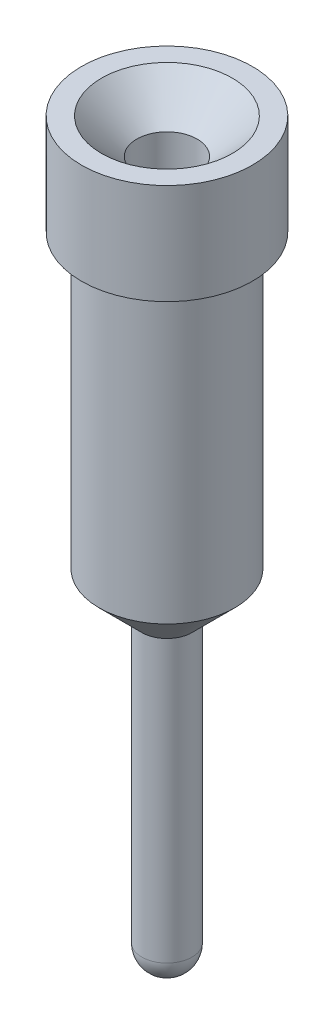
ISO-10303-21;
HEADER;
FILE_DESCRIPTION(('STEP AP214'),'2;1');
FILE_NAME('part.step','',(''),(''),'','','');
FILE_SCHEMA(('AUTOMOTIVE_DESIGN { 1 0 10303 214 1 1 1 1 }'));
ENDSEC;
DATA;
#1=APPLICATION_CONTEXT('core data for automotive mechanical design processes');
#2=APPLICATION_PROTOCOL_DEFINITION('international standard','automotive_design',2000,#1);
#3=PRODUCT_CONTEXT('',#1,'mechanical');
#4=PRODUCT('Part','Part','',(#3));
#5=PRODUCT_RELATED_PRODUCT_CATEGORY('part','',(#4));
#6=PRODUCT_DEFINITION_FORMATION('','',#4);
#7=PRODUCT_DEFINITION_CONTEXT('part definition',#1,'design');
#8=PRODUCT_DEFINITION('design','',#6,#7);
#9=PRODUCT_DEFINITION_SHAPE('','',#8);
#10=(LENGTH_UNIT() NAMED_UNIT(*) SI_UNIT(.MILLI.,.METRE.));
#11=(NAMED_UNIT(*) PLANE_ANGLE_UNIT() SI_UNIT($,.RADIAN.));
#12=(NAMED_UNIT(*) SI_UNIT($,.STERADIAN.) SOLID_ANGLE_UNIT());
#13=UNCERTAINTY_MEASURE_WITH_UNIT(LENGTH_MEASURE(1.E-05),#10,'distance_accuracy_value','');
#14=(GEOMETRIC_REPRESENTATION_CONTEXT(3) GLOBAL_UNCERTAINTY_ASSIGNED_CONTEXT((#13)) GLOBAL_UNIT_ASSIGNED_CONTEXT((#10,
#11,#12)) REPRESENTATION_CONTEXT('',''));
#15=CARTESIAN_POINT('',(0.,0.,0.));
#16=DIRECTION('',(0.,0.,1.));
#17=DIRECTION('',(1.,0.,0.));
#18=AXIS2_PLACEMENT_3D('',#15,#16,#17);
#19=CARTESIAN_POINT('',(-0.849999999999997,0.,0.));
#20=DIRECTION('',(0.,1.,0.));
#21=DIRECTION('',(0.,0.,1.));
#22=AXIS2_PLACEMENT_3D('',#19,#20,#21);
#23=PLANE('',#22);
#24=CARTESIAN_POINT('',(0.,0.,0.));
#25=DIRECTION('',(0.,1.,0.));
#26=DIRECTION('',(0.,0.,1.));
#27=AXIS2_PLACEMENT_3D('',#24,#25,#26);
#28=CIRCLE('',#27,0.849999999999997);
#29=CARTESIAN_POINT('',(0.,0.,0.849999999999997));
#30=VERTEX_POINT('',#29);
#31=EDGE_CURVE('E11',#30,#30,#28,.T.);
#32=ORIENTED_EDGE('',*,*,#31,.T.);
#33=EDGE_LOOP('',(#32));
#34=FACE_BOUND('',#33,.T.);
#35=CARTESIAN_POINT('',(0.,0.,0.));
#36=DIRECTION('',(0.,1.,0.));
#37=DIRECTION('',(0.,0.,1.));
#38=AXIS2_PLACEMENT_3D('',#35,#36,#37);
#39=CIRCLE('',#38,0.649999999999995);
#40=CARTESIAN_POINT('',(0.,0.,0.649999999999995));
#41=VERTEX_POINT('',#40);
#42=EDGE_CURVE('E75',#41,#41,#39,.T.);
#43=ORIENTED_EDGE('',*,*,#42,.F.);
#44=EDGE_LOOP('',(#43));
#45=FACE_BOUND('',#44,.T.);
#46=ADVANCED_FACE('F37',(#34,#45),#23,.T.);
#47=CARTESIAN_POINT('',(0.,28.992562867327,0.));
#48=DIRECTION('',(0.,1.,0.));
#49=DIRECTION('',(0.,0.,1.));
#50=AXIS2_PLACEMENT_3D('',#47,#48,#49);
#51=CYLINDRICAL_SURFACE('',#50,0.849999999999996);
#52=CARTESIAN_POINT('',(0.,-1.,0.));
#53=DIRECTION('',(0.,1.,0.));
#54=DIRECTION('',(0.,0.,1.));
#55=AXIS2_PLACEMENT_3D('',#52,#53,#54);
#56=CIRCLE('',#55,0.849999999999996);
#57=CARTESIAN_POINT('',(0.,-1.,0.849999999999996));
#58=VERTEX_POINT('',#57);
#59=EDGE_CURVE('E43',#58,#58,#56,.T.);
#60=ORIENTED_EDGE('',*,*,#59,.T.);
#61=EDGE_LOOP('',(#60));
#62=FACE_BOUND('',#61,.T.);
#63=ORIENTED_EDGE('',*,*,#31,.F.);
#64=EDGE_LOOP('',(#63));
#65=FACE_BOUND('',#64,.T.);
#66=ADVANCED_FACE('F64',(#62,#65),#51,.T.);
#67=CARTESIAN_POINT('',(-0.849999999999996,-0.999999999999999,0.));
#68=DIRECTION('',(0.,-1.,0.));
#69=DIRECTION('',(0.,0.,-1.));
#70=AXIS2_PLACEMENT_3D('',#67,#68,#69);
#71=PLANE('',#70);
#72=CARTESIAN_POINT('',(0.,-1.,0.));
#73=DIRECTION('',(0.,1.,0.));
#74=DIRECTION('',(0.,0.,1.));
#75=AXIS2_PLACEMENT_3D('',#72,#73,#74);
#76=CIRCLE('',#75,0.674999999999996);
#77=CARTESIAN_POINT('',(0.,-1.,0.674999999999996));
#78=VERTEX_POINT('',#77);
#79=EDGE_CURVE('E93',#78,#78,#76,.T.);
#80=ORIENTED_EDGE('',*,*,#79,.T.);
#81=EDGE_LOOP('',(#80));
#82=FACE_BOUND('',#81,.T.);
#83=ORIENTED_EDGE('',*,*,#59,.F.);
#84=EDGE_LOOP('',(#83));
#85=FACE_BOUND('',#84,.T.);
#86=ADVANCED_FACE('F69',(#82,#85),#71,.T.);
#87=CARTESIAN_POINT('',(0.,28.992562867327,0.));
#88=DIRECTION('',(0.,1.,0.));
#89=DIRECTION('',(0.,0.,1.));
#90=AXIS2_PLACEMENT_3D('',#87,#88,#89);
#91=CYLINDRICAL_SURFACE('',#90,0.674999999999996);
#92=CARTESIAN_POINT('',(0.,-3.9,0.));
#93=DIRECTION('',(0.,1.,0.));
#94=DIRECTION('',(0.,0.,1.));
#95=AXIS2_PLACEMENT_3D('',#92,#93,#94);
#96=CIRCLE('',#95,0.674999999999995);
#97=CARTESIAN_POINT('',(0.,-3.9,0.674999999999995));
#98=VERTEX_POINT('',#97);
#99=EDGE_CURVE('E90',#98,#98,#96,.T.);
#100=ORIENTED_EDGE('',*,*,#99,.T.);
#101=EDGE_LOOP('',(#100));
#102=FACE_BOUND('',#101,.T.);
#103=ORIENTED_EDGE('',*,*,#79,.F.);
#104=EDGE_LOOP('',(#103));
#105=FACE_BOUND('',#104,.T.);
#106=ADVANCED_FACE('F100',(#102,#105),#91,.T.);
#107=CARTESIAN_POINT('',(0.,-3.9,0.));
#108=DIRECTION('',(0.,1.,0.));
#109=DIRECTION('',(0.,0.,1.));
#110=AXIS2_PLACEMENT_3D('',#107,#108,#109);
#111=CONICAL_SURFACE('',#110,0.674999999999995,0.785398163397453);
#112=CARTESIAN_POINT('',(0.,-4.325,0.));
#113=DIRECTION('',(0.,1.,0.));
#114=DIRECTION('',(0.,0.,1.));
#115=AXIS2_PLACEMENT_3D('',#112,#113,#114);
#116=CIRCLE('',#115,0.249999999999996);
#117=CARTESIAN_POINT('',(0.,-4.325,0.249999999999996));
#118=VERTEX_POINT('',#117);
#119=EDGE_CURVE('E87',#118,#118,#116,.T.);
#120=ORIENTED_EDGE('',*,*,#119,.T.);
#121=EDGE_LOOP('',(#120));
#122=FACE_BOUND('',#121,.T.);
#123=ORIENTED_EDGE('',*,*,#99,.F.);
#124=EDGE_LOOP('',(#123));
#125=FACE_BOUND('',#124,.T.);
#126=ADVANCED_FACE('F106',(#122,#125),#111,.T.);
#127=CARTESIAN_POINT('',(0.,28.992562867327,0.));
#128=DIRECTION('',(0.,1.,0.));
#129=DIRECTION('',(0.,0.,1.));
#130=AXIS2_PLACEMENT_3D('',#127,#128,#129);
#131=CYLINDRICAL_SURFACE('',#130,0.249999999999996);
#132=CARTESIAN_POINT('',(0.,-7.12,0.));
#133=DIRECTION('',(0.,1.,0.));
#134=DIRECTION('',(0.,0.,1.));
#135=AXIS2_PLACEMENT_3D('',#132,#133,#134);
#136=CIRCLE('',#135,0.249999999999996);
#137=CARTESIAN_POINT('',(0.,-7.12,0.249999999999996));
#138=VERTEX_POINT('',#137);
#139=EDGE_CURVE('E84',#138,#138,#136,.T.);
#140=ORIENTED_EDGE('',*,*,#139,.T.);
#141=EDGE_LOOP('',(#140));
#142=FACE_BOUND('',#141,.T.);
#143=ORIENTED_EDGE('',*,*,#119,.F.);
#144=EDGE_LOOP('',(#143));
#145=FACE_BOUND('',#144,.T.);
#146=ADVANCED_FACE('F59',(#142,#145),#131,.T.);
#147=CARTESIAN_POINT('',(0.,-7.12,0.));
#148=DIRECTION('',(0.,1.,0.));
#149=DIRECTION('',(-1.,0.,0.));
#150=AXIS2_PLACEMENT_3D('',#147,#148,#149);
#151=SPHERICAL_SURFACE('',#150,0.249999999999996);
#152=ORIENTED_EDGE('',*,*,#139,.F.);
#153=EDGE_LOOP('',(#152));
#154=FACE_BOUND('',#153,.T.);
#155=ADVANCED_FACE('F49',(#154),#151,.T.);
#156=CARTESIAN_POINT('',(0.,-4.,0.));
#157=DIRECTION('',(0.,1.,0.));
#158=DIRECTION('',(0.,0.,1.));
#159=AXIS2_PLACEMENT_3D('',#156,#157,#158);
#160=CONICAL_SURFACE('',#159,0.,0.785398163397442);
#161=CARTESIAN_POINT('',(0.,-3.7,0.));
#162=DIRECTION('',(0.,1.,0.));
#163=DIRECTION('',(0.,0.,1.));
#164=AXIS2_PLACEMENT_3D('',#161,#162,#163);
#165=CIRCLE('',#164,0.299999999999995);
#166=CARTESIAN_POINT('',(0.,-3.7,0.299999999999995));
#167=VERTEX_POINT('',#166);
#168=EDGE_CURVE('E80',#167,#167,#165,.T.);
#169=ORIENTED_EDGE('',*,*,#168,.T.);
#170=EDGE_LOOP('',(#169));
#171=FACE_BOUND('',#170,.T.);
#172=CARTESIAN_POINT('',(0.,-4.,0.));
#173=VERTEX_POINT('',#172);
#174=VERTEX_LOOP('',#173);
#175=FACE_BOUND('',#174,.T.);
#176=ADVANCED_FACE('F46',(#171,#175),#160,.F.);
#177=CARTESIAN_POINT('',(0.,28.992562867327,0.));
#178=DIRECTION('',(0.,1.,0.));
#179=DIRECTION('',(0.,0.,1.));
#180=AXIS2_PLACEMENT_3D('',#177,#178,#179);
#181=CYLINDRICAL_SURFACE('',#180,0.299999999999996);
#182=CARTESIAN_POINT('',(0.,-0.35,0.));
#183=DIRECTION('',(0.,1.,0.));
#184=DIRECTION('',(0.,0.,1.));
#185=AXIS2_PLACEMENT_3D('',#182,#183,#184);
#186=CIRCLE('',#185,0.299999999999996);
#187=CARTESIAN_POINT('',(0.,-0.35,0.299999999999996));
#188=VERTEX_POINT('',#187);
#189=EDGE_CURVE('E77',#188,#188,#186,.T.);
#190=ORIENTED_EDGE('',*,*,#189,.T.);
#191=EDGE_LOOP('',(#190));
#192=FACE_BOUND('',#191,.T.);
#193=ORIENTED_EDGE('',*,*,#168,.F.);
#194=EDGE_LOOP('',(#193));
#195=FACE_BOUND('',#194,.T.);
#196=ADVANCED_FACE('F48',(#192,#195),#181,.F.);
#197=CARTESIAN_POINT('',(0.,-0.35,0.));
#198=DIRECTION('',(0.,1.,0.));
#199=DIRECTION('',(0.,0.,1.));
#200=AXIS2_PLACEMENT_3D('',#197,#198,#199);
#201=CONICAL_SURFACE('',#200,0.299999999999996,0.785398163397447);
#202=ORIENTED_EDGE('',*,*,#42,.T.);
#203=EDGE_LOOP('',(#202));
#204=FACE_BOUND('',#203,.T.);
#205=ORIENTED_EDGE('',*,*,#189,.F.);
#206=EDGE_LOOP('',(#205));
#207=FACE_BOUND('',#206,.T.);
#208=ADVANCED_FACE('F56',(#204,#207),#201,.F.);
#209=CLOSED_SHELL('',(#46,#66,#86,#106,#126,#146,#155,#176,#196,#208));
#210=MANIFOLD_SOLID_BREP('B2',#209);
#211=ADVANCED_BREP_SHAPE_REPRESENTATION('',(#18,#210),#14);
#212=SHAPE_DEFINITION_REPRESENTATION(#9,#211);
ENDSEC;
END-ISO-10303-21;
